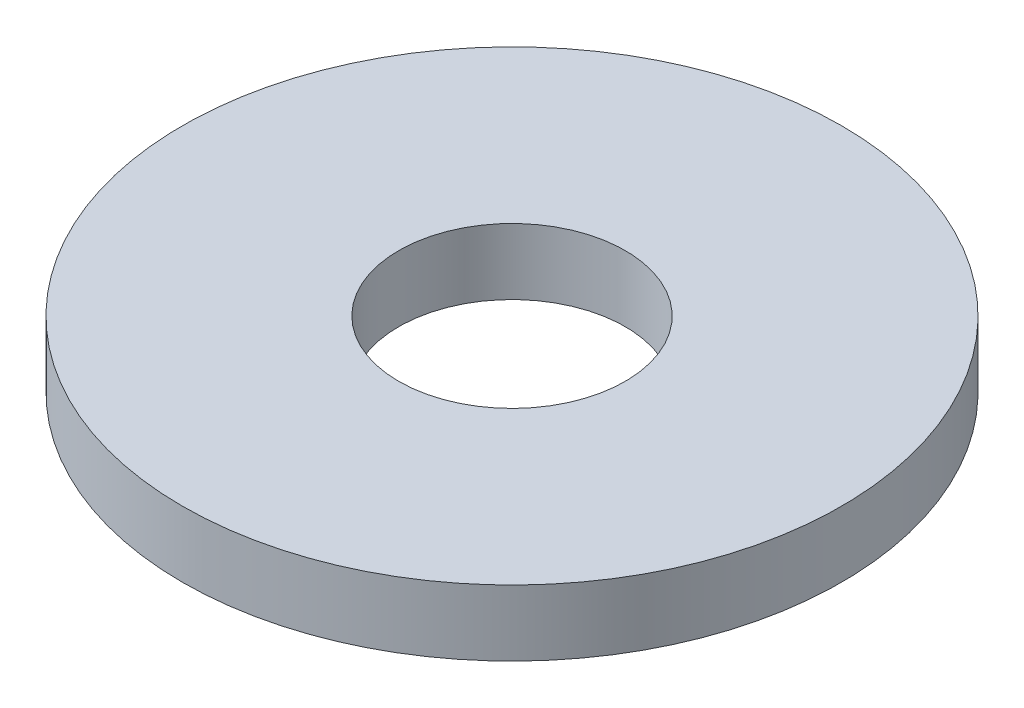
ISO-10303-21;
HEADER;
FILE_DESCRIPTION(('STEP AP214'),'2;1');
FILE_NAME('part.step','',(''),(''),'','','');
FILE_SCHEMA(('AUTOMOTIVE_DESIGN { 1 0 10303 214 1 1 1 1 }'));
ENDSEC;
DATA;
#1=APPLICATION_CONTEXT('core data for automotive mechanical design processes');
#2=APPLICATION_PROTOCOL_DEFINITION('international standard','automotive_design',2000,#1);
#3=PRODUCT_CONTEXT('',#1,'mechanical');
#4=PRODUCT('Part','Part','',(#3));
#5=PRODUCT_RELATED_PRODUCT_CATEGORY('part','',(#4));
#6=PRODUCT_DEFINITION_FORMATION('','',#4);
#7=PRODUCT_DEFINITION_CONTEXT('part definition',#1,'design');
#8=PRODUCT_DEFINITION('design','',#6,#7);
#9=PRODUCT_DEFINITION_SHAPE('','',#8);
#10=(LENGTH_UNIT() NAMED_UNIT(*) SI_UNIT(.MILLI.,.METRE.));
#11=(NAMED_UNIT(*) PLANE_ANGLE_UNIT() SI_UNIT($,.RADIAN.));
#12=(NAMED_UNIT(*) SI_UNIT($,.STERADIAN.) SOLID_ANGLE_UNIT());
#13=UNCERTAINTY_MEASURE_WITH_UNIT(LENGTH_MEASURE(1.E-05),#10,'distance_accuracy_value','');
#14=(GEOMETRIC_REPRESENTATION_CONTEXT(3) GLOBAL_UNCERTAINTY_ASSIGNED_CONTEXT((#13)) GLOBAL_UNIT_ASSIGNED_CONTEXT((#10,
#11,#12)) REPRESENTATION_CONTEXT('',''));
#15=CARTESIAN_POINT('',(0.,0.,0.));
#16=DIRECTION('',(0.,0.,1.));
#17=DIRECTION('',(1.,0.,0.));
#18=AXIS2_PLACEMENT_3D('',#15,#16,#17);
#19=CARTESIAN_POINT('',(0.,16.,0.));
#20=DIRECTION('',(0.,-1.,0.));
#21=DIRECTION('',(0.,0.,-1.));
#22=AXIS2_PLACEMENT_3D('',#19,#20,#21);
#23=CYLINDRICAL_SURFACE('',#22,80.);
#24=CARTESIAN_POINT('',(0.,16.,0.));
#25=DIRECTION('',(0.,1.,0.));
#26=DIRECTION('',(0.,0.,1.));
#27=AXIS2_PLACEMENT_3D('',#24,#25,#26);
#28=CIRCLE('',#27,80.);
#29=CARTESIAN_POINT('',(0.,16.,80.));
#30=VERTEX_POINT('',#29);
#31=EDGE_CURVE('E10',#30,#30,#28,.T.);
#32=ORIENTED_EDGE('',*,*,#31,.F.);
#33=EDGE_LOOP('',(#32));
#34=FACE_BOUND('',#33,.T.);
#35=CARTESIAN_POINT('',(0.,0.,0.));
#36=DIRECTION('',(0.,1.,0.));
#37=DIRECTION('',(0.,0.,1.));
#38=AXIS2_PLACEMENT_3D('',#35,#36,#37);
#39=CIRCLE('',#38,80.);
#40=CARTESIAN_POINT('',(0.,0.,80.));
#41=VERTEX_POINT('',#40);
#42=EDGE_CURVE('E37',#41,#41,#39,.T.);
#43=ORIENTED_EDGE('',*,*,#42,.T.);
#44=EDGE_LOOP('',(#43));
#45=FACE_BOUND('',#44,.T.);
#46=ADVANCED_FACE('F40',(#34,#45),#23,.T.);
#47=CARTESIAN_POINT('',(0.,16.,0.));
#48=DIRECTION('',(0.,1.,0.));
#49=DIRECTION('',(0.,0.,1.));
#50=AXIS2_PLACEMENT_3D('',#47,#48,#49);
#51=PLANE('',#50);
#52=CARTESIAN_POINT('',(0.,16.,0.));
#53=DIRECTION('',(0.,1.,0.));
#54=DIRECTION('',(0.,0.,1.));
#55=AXIS2_PLACEMENT_3D('',#52,#53,#54);
#56=CIRCLE('',#55,27.5);
#57=CARTESIAN_POINT('',(0.,16.,27.5));
#58=VERTEX_POINT('',#57);
#59=EDGE_CURVE('E50',#58,#58,#56,.T.);
#60=ORIENTED_EDGE('',*,*,#59,.F.);
#61=EDGE_LOOP('',(#60));
#62=FACE_BOUND('',#61,.T.);
#63=ORIENTED_EDGE('',*,*,#31,.T.);
#64=EDGE_LOOP('',(#63));
#65=FACE_BOUND('',#64,.T.);
#66=ADVANCED_FACE('F59',(#62,#65),#51,.T.);
#67=CARTESIAN_POINT('',(0.,0.,0.));
#68=DIRECTION('',(0.,1.,0.));
#69=DIRECTION('',(0.,0.,1.));
#70=AXIS2_PLACEMENT_3D('',#67,#68,#69);
#71=PLANE('',#70);
#72=CARTESIAN_POINT('',(0.,0.,0.));
#73=DIRECTION('',(0.,1.,0.));
#74=DIRECTION('',(0.,0.,1.));
#75=AXIS2_PLACEMENT_3D('',#72,#73,#74);
#76=CIRCLE('',#75,27.5);
#77=CARTESIAN_POINT('',(0.,0.,27.5));
#78=VERTEX_POINT('',#77);
#79=EDGE_CURVE('E47',#78,#78,#76,.T.);
#80=ORIENTED_EDGE('',*,*,#79,.T.);
#81=EDGE_LOOP('',(#80));
#82=FACE_BOUND('',#81,.T.);
#83=ORIENTED_EDGE('',*,*,#42,.F.);
#84=EDGE_LOOP('',(#83));
#85=FACE_BOUND('',#84,.T.);
#86=ADVANCED_FACE('F58',(#82,#85),#71,.F.);
#87=CARTESIAN_POINT('',(0.,16.,0.));
#88=DIRECTION('',(0.,-1.,0.));
#89=DIRECTION('',(0.,0.,-1.));
#90=AXIS2_PLACEMENT_3D('',#87,#88,#89);
#91=CYLINDRICAL_SURFACE('',#90,27.5);
#92=ORIENTED_EDGE('',*,*,#59,.T.);
#93=EDGE_LOOP('',(#92));
#94=FACE_BOUND('',#93,.T.);
#95=ORIENTED_EDGE('',*,*,#79,.F.);
#96=EDGE_LOOP('',(#95));
#97=FACE_BOUND('',#96,.T.);
#98=ADVANCED_FACE('F54',(#94,#97),#91,.F.);
#99=CLOSED_SHELL('',(#46,#66,#86,#98));
#100=MANIFOLD_SOLID_BREP('B2',#99);
#101=ADVANCED_BREP_SHAPE_REPRESENTATION('',(#18,#100),#14);
#102=SHAPE_DEFINITION_REPRESENTATION(#9,#101);
ENDSEC;
END-ISO-10303-21;
